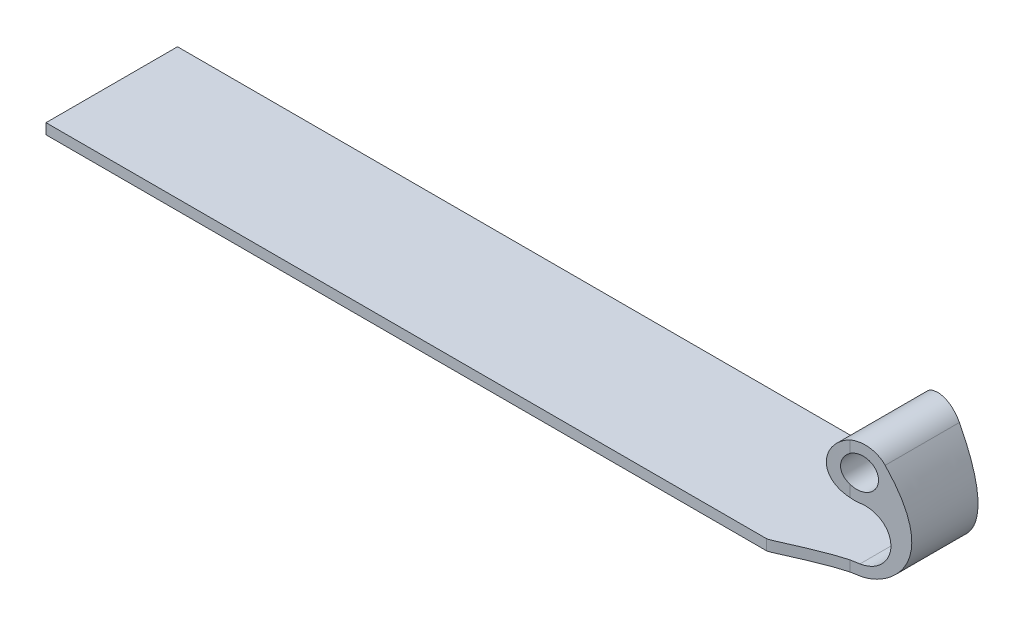
ISO-10303-21;
HEADER;
FILE_DESCRIPTION(('STEP AP214'),'2;1');
FILE_NAME('part.step','',(''),(''),'','','');
FILE_SCHEMA(('AUTOMOTIVE_DESIGN { 1 0 10303 214 1 1 1 1 }'));
ENDSEC;
DATA;
#1=APPLICATION_CONTEXT('core data for automotive mechanical design processes');
#2=APPLICATION_PROTOCOL_DEFINITION('international standard','automotive_design',2000,#1);
#3=PRODUCT_CONTEXT('',#1,'mechanical');
#4=PRODUCT('Part','Part','',(#3));
#5=PRODUCT_RELATED_PRODUCT_CATEGORY('part','',(#4));
#6=PRODUCT_DEFINITION_FORMATION('','',#4);
#7=PRODUCT_DEFINITION_CONTEXT('part definition',#1,'design');
#8=PRODUCT_DEFINITION('design','',#6,#7);
#9=PRODUCT_DEFINITION_SHAPE('','',#8);
#10=(LENGTH_UNIT() NAMED_UNIT(*) SI_UNIT(.MILLI.,.METRE.));
#11=(NAMED_UNIT(*) PLANE_ANGLE_UNIT() SI_UNIT($,.RADIAN.));
#12=(NAMED_UNIT(*) SI_UNIT($,.STERADIAN.) SOLID_ANGLE_UNIT());
#13=UNCERTAINTY_MEASURE_WITH_UNIT(LENGTH_MEASURE(1.E-05),#10,'distance_accuracy_value','');
#14=(GEOMETRIC_REPRESENTATION_CONTEXT(3) GLOBAL_UNCERTAINTY_ASSIGNED_CONTEXT((#13)) GLOBAL_UNIT_ASSIGNED_CONTEXT((#10,
#11,#12)) REPRESENTATION_CONTEXT('',''));
#15=CARTESIAN_POINT('',(0.,0.,0.));
#16=DIRECTION('',(0.,0.,1.));
#17=DIRECTION('',(1.,0.,0.));
#18=AXIS2_PLACEMENT_3D('',#15,#16,#17);
#19=CARTESIAN_POINT('',(-38.1,1.016,-6.35));
#20=DIRECTION('',(0.,0.,1.));
#21=DIRECTION('',(1.,0.,0.));
#22=AXIS2_PLACEMENT_3D('',#19,#20,#21);
#23=PLANE('',#22);
#24=DIRECTION('',(0.,1.,0.));
#25=VECTOR('',#24,1.);
#26=CARTESIAN_POINT('',(31.4618728230442,-8.984,-6.35));
#27=LINE('',#26,#25);
#28=CARTESIAN_POINT('',(31.4618728230442,0.,-6.35));
#29=VERTEX_POINT('',#28);
#30=CARTESIAN_POINT('',(31.4618728230442,1.016,-6.35));
#31=VERTEX_POINT('',#30);
#32=EDGE_CURVE('E257',#29,#31,#27,.T.);
#33=ORIENTED_EDGE('',*,*,#32,.F.);
#34=DIRECTION('',(-1.,0.,0.));
#35=VECTOR('',#34,1.);
#36=CARTESIAN_POINT('',(-38.1,0.,-6.35));
#37=LINE('',#36,#35);
#38=CARTESIAN_POINT('',(-38.1,0.,-6.35));
#39=VERTEX_POINT('',#38);
#40=EDGE_CURVE('E277',#29,#39,#37,.T.);
#41=ORIENTED_EDGE('',*,*,#40,.T.);
#42=DIRECTION('',(0.,-1.,0.));
#43=VECTOR('',#42,1.);
#44=CARTESIAN_POINT('',(-38.1,1.016,-6.35));
#45=LINE('',#44,#43);
#46=CARTESIAN_POINT('',(-38.1,1.016,-6.35));
#47=VERTEX_POINT('',#46);
#48=EDGE_CURVE('E311',#47,#39,#45,.T.);
#49=ORIENTED_EDGE('',*,*,#48,.F.);
#50=DIRECTION('',(-1.,0.,0.));
#51=VECTOR('',#50,1.);
#52=CARTESIAN_POINT('',(-38.1,1.016,-6.35));
#53=LINE('',#52,#51);
#54=EDGE_CURVE('E292',#31,#47,#53,.T.);
#55=ORIENTED_EDGE('',*,*,#54,.F.);
#56=EDGE_LOOP('',(#33,#41,#49,#55));
#57=FACE_BOUND('',#56,.T.);
#58=ADVANCED_FACE('F37',(#57),#23,.F.);
#59=CARTESIAN_POINT('',(0.,1.016,0.));
#60=DIRECTION('',(0.,-1.,0.));
#61=DIRECTION('',(0.,0.,-1.));
#62=AXIS2_PLACEMENT_3D('',#59,#60,#61);
#63=PLANE('',#62);
#64=CARTESIAN_POINT('',(39.2056630331056,1.016,-3.75211753897652));
#65=CARTESIAN_POINT('',(36.3576672367003,1.016,-3.87614198539521));
#66=CARTESIAN_POINT('',(31.9938209662141,1.016,-6.35));
#67=CARTESIAN_POINT('',(31.4618728230442,1.016,-6.35));
#68=B_SPLINE_CURVE_WITH_KNOTS('',3,(#64,#65,#66,#67),.UNSPECIFIED.,.F.,.F.,(4,4),(0.,1.),.UNSPECIFIED.);
#69=CARTESIAN_POINT('',(37.2738999237345,1.016,-4.09273949549593));
#70=VERTEX_POINT('',#69);
#71=EDGE_CURVE('E281',#31,#70,#68,.F.);
#72=ORIENTED_EDGE('',*,*,#71,.F.);
#73=ORIENTED_EDGE('',*,*,#54,.T.);
#74=DIRECTION('',(0.,0.,1.));
#75=VECTOR('',#74,1.);
#76=CARTESIAN_POINT('',(-38.1,1.016,6.35));
#77=LINE('',#76,#75);
#78=CARTESIAN_POINT('',(-38.1,1.016,6.35));
#79=VERTEX_POINT('',#78);
#80=EDGE_CURVE('E296',#47,#79,#77,.T.);
#81=ORIENTED_EDGE('',*,*,#80,.T.);
#82=DIRECTION('',(1.,0.,0.));
#83=VECTOR('',#82,1.);
#84=CARTESIAN_POINT('',(-38.1,1.016,6.35));
#85=LINE('',#84,#83);
#86=CARTESIAN_POINT('',(31.4618728230442,1.016,6.35));
#87=VERTEX_POINT('',#86);
#88=EDGE_CURVE('E298',#79,#87,#85,.T.);
#89=ORIENTED_EDGE('',*,*,#88,.T.);
#90=CARTESIAN_POINT('',(39.2056630331056,1.016,3.75211753897652));
#91=CARTESIAN_POINT('',(36.3576672367003,1.016,3.87614198539521));
#92=CARTESIAN_POINT('',(31.9938209662141,1.016,6.35));
#93=CARTESIAN_POINT('',(31.4618728230442,1.016,6.35));
#94=B_SPLINE_CURVE_WITH_KNOTS('',3,(#90,#91,#92,#93),.UNSPECIFIED.,.F.,.F.,(4,4),(0.,1.),.UNSPECIFIED.);
#95=CARTESIAN_POINT('',(37.2738999237345,1.016,4.09273949549593));
#96=VERTEX_POINT('',#95);
#97=EDGE_CURVE('E180',#87,#96,#94,.F.);
#98=ORIENTED_EDGE('',*,*,#97,.T.);
#99=DIRECTION('',(-0.984807753012208,0.,0.173648177666931));
#100=VECTOR('',#99,1.);
#101=CARTESIAN_POINT('',(1.82384528316646,1.016,10.3435405962174));
#102=LINE('',#101,#100);
#103=CARTESIAN_POINT('',(38.1,1.016,3.94707576328499));
#104=VERTEX_POINT('',#103);
#105=EDGE_CURVE('E187',#104,#96,#102,.T.);
#106=ORIENTED_EDGE('',*,*,#105,.F.);
#107=DIRECTION('',(0.,0.,-1.));
#108=VECTOR('',#107,1.);
#109=CARTESIAN_POINT('',(38.1,1.016,6.35));
#110=LINE('',#109,#108);
#111=CARTESIAN_POINT('',(38.1,1.016,-3.94707576328499));
#112=VERTEX_POINT('',#111);
#113=EDGE_CURVE('E289',#104,#112,#110,.T.);
#114=ORIENTED_EDGE('',*,*,#113,.T.);
#115=DIRECTION('',(-0.984807753012208,0.,-0.173648177666931));
#116=VECTOR('',#115,1.);
#117=CARTESIAN_POINT('',(1.82384528316646,1.016,-10.3435405962174));
#118=LINE('',#117,#116);
#119=EDGE_CURVE('E342',#112,#70,#118,.T.);
#120=ORIENTED_EDGE('',*,*,#119,.T.);
#121=EDGE_LOOP('',(#72,#73,#81,#89,#98,#106,#114,#120));
#122=FACE_BOUND('',#121,.T.);
#123=ADVANCED_FACE('F353',(#122),#63,.F.);
#124=CARTESIAN_POINT('',(0.,0.,0.));
#125=DIRECTION('',(0.,-1.,0.));
#126=DIRECTION('',(0.,0.,-1.));
#127=AXIS2_PLACEMENT_3D('',#124,#125,#126);
#128=PLANE('',#127);
#129=ORIENTED_EDGE('',*,*,#40,.F.);
#130=CARTESIAN_POINT('',(39.2056630331056,0.,-3.75211753897652));
#131=CARTESIAN_POINT('',(36.3576672367003,0.,-3.87614198539521));
#132=CARTESIAN_POINT('',(31.9938209662141,0.,-6.35));
#133=CARTESIAN_POINT('',(31.4618728230442,0.,-6.35));
#134=B_SPLINE_CURVE_WITH_KNOTS('',3,(#130,#131,#132,#133),.UNSPECIFIED.,.F.,.F.,(4,4),(0.,1.),.UNSPECIFIED.);
#135=CARTESIAN_POINT('',(37.2738999237345,0.,-4.09273949549593));
#136=VERTEX_POINT('',#135);
#137=EDGE_CURVE('E369',#29,#136,#134,.F.);
#138=ORIENTED_EDGE('',*,*,#137,.T.);
#139=DIRECTION('',(-0.984807753012208,0.,-0.173648177666931));
#140=VECTOR('',#139,1.);
#141=CARTESIAN_POINT('',(1.82384528316646,0.,-10.3435405962174));
#142=LINE('',#141,#140);
#143=CARTESIAN_POINT('',(38.1,0.,-3.94707576328499));
#144=VERTEX_POINT('',#143);
#145=EDGE_CURVE('E340',#144,#136,#142,.T.);
#146=ORIENTED_EDGE('',*,*,#145,.F.);
#147=DIRECTION('',(0.,0.,-1.));
#148=VECTOR('',#147,1.);
#149=CARTESIAN_POINT('',(38.1,0.,6.35));
#150=LINE('',#149,#148);
#151=CARTESIAN_POINT('',(38.1,0.,3.94707576328499));
#152=VERTEX_POINT('',#151);
#153=EDGE_CURVE('E196',#152,#144,#150,.T.);
#154=ORIENTED_EDGE('',*,*,#153,.F.);
#155=DIRECTION('',(-0.984807753012208,0.,0.173648177666931));
#156=VECTOR('',#155,1.);
#157=CARTESIAN_POINT('',(1.82384528316646,0.,10.3435405962174));
#158=LINE('',#157,#156);
#159=CARTESIAN_POINT('',(37.2738999237345,0.,4.09273949549593));
#160=VERTEX_POINT('',#159);
#161=EDGE_CURVE('E184',#152,#160,#158,.T.);
#162=ORIENTED_EDGE('',*,*,#161,.T.);
#163=CARTESIAN_POINT('',(39.2056630331056,0.,3.75211753897652));
#164=CARTESIAN_POINT('',(36.3576672367003,0.,3.87614198539521));
#165=CARTESIAN_POINT('',(31.9938209662141,0.,6.35));
#166=CARTESIAN_POINT('',(31.4618728230442,0.,6.35));
#167=B_SPLINE_CURVE_WITH_KNOTS('',3,(#163,#164,#165,#166),.UNSPECIFIED.,.F.,.F.,(4,4),(0.,1.),.UNSPECIFIED.);
#168=CARTESIAN_POINT('',(31.4618728230442,0.,6.35));
#169=VERTEX_POINT('',#168);
#170=EDGE_CURVE('E168',#169,#160,#167,.F.);
#171=ORIENTED_EDGE('',*,*,#170,.F.);
#172=DIRECTION('',(1.,0.,0.));
#173=VECTOR('',#172,1.);
#174=CARTESIAN_POINT('',(-38.1,0.,6.35));
#175=LINE('',#174,#173);
#176=CARTESIAN_POINT('',(-38.1,0.,6.35));
#177=VERTEX_POINT('',#176);
#178=EDGE_CURVE('E293',#177,#169,#175,.T.);
#179=ORIENTED_EDGE('',*,*,#178,.F.);
#180=DIRECTION('',(0.,0.,1.));
#181=VECTOR('',#180,1.);
#182=CARTESIAN_POINT('',(-38.1,0.,6.35));
#183=LINE('',#182,#181);
#184=EDGE_CURVE('E305',#39,#177,#183,.T.);
#185=ORIENTED_EDGE('',*,*,#184,.F.);
#186=EDGE_LOOP('',(#129,#138,#146,#154,#162,#171,#179,#185));
#187=FACE_BOUND('',#186,.T.);
#188=ADVANCED_FACE('F193',(#187),#128,.T.);
#189=CARTESIAN_POINT('',(38.1,3.556,6.35));
#190=DIRECTION('',(0.,0.,-1.));
#191=DIRECTION('',(-1.,0.,0.));
#192=AXIS2_PLACEMENT_3D('',#189,#190,#191);
#193=CYLINDRICAL_SURFACE('',#192,2.54);
#194=CARTESIAN_POINT('',(38.1,3.556,-3.94707576328499));
#195=DIRECTION('',(-0.173648177666931,0.,0.984807753012208));
#196=DIRECTION('',(-0.984807753012208,0.,-0.173648177666931));
#197=AXIS2_PLACEMENT_3D('',#194,#195,#196);
#198=ELLIPSE('',#197,2.57918359418979,2.54);
#199=CARTESIAN_POINT('',(38.1,6.096,-3.94707576328499));
#200=VERTEX_POINT('',#199);
#201=EDGE_CURVE('E72',#112,#200,#198,.T.);
#202=ORIENTED_EDGE('',*,*,#201,.F.);
#203=ORIENTED_EDGE('',*,*,#113,.F.);
#204=CARTESIAN_POINT('',(38.1,3.556,3.94707576328499));
#205=DIRECTION('',(0.173648177666931,0.,0.984807753012208));
#206=DIRECTION('',(0.984807753012208,0.,-0.173648177666931));
#207=AXIS2_PLACEMENT_3D('',#204,#205,#206);
#208=ELLIPSE('',#207,2.57918359418979,2.54);
#209=CARTESIAN_POINT('',(38.1,6.096,3.94707576328499));
#210=VERTEX_POINT('',#209);
#211=EDGE_CURVE('E256',#104,#210,#208,.T.);
#212=ORIENTED_EDGE('',*,*,#211,.T.);
#213=DIRECTION('',(0.,0.,-1.));
#214=VECTOR('',#213,1.);
#215=CARTESIAN_POINT('',(38.1,6.096,6.35));
#216=LINE('',#215,#214);
#217=EDGE_CURVE('E274',#210,#200,#216,.T.);
#218=ORIENTED_EDGE('',*,*,#217,.T.);
#219=EDGE_LOOP('',(#202,#203,#212,#218));
#220=FACE_BOUND('',#219,.T.);
#221=ADVANCED_FACE('F331',(#220),#193,.F.);
#222=CARTESIAN_POINT('',(40.16864649384,10.1098730215061,6.35));
#223=CARTESIAN_POINT('',(43.8111052533142,4.99751976461316,6.35));
#224=CARTESIAN_POINT('',(42.8225920973942,1.81527670168074,6.35));
#225=CARTESIAN_POINT('',(40.0156055783276,0.,6.35));
#226=CARTESIAN_POINT('',(38.1,0.,6.35));
#227=B_SPLINE_CURVE_WITH_KNOTS('',4,(#222,#223,#224,#225,#226),.UNSPECIFIED.,.F.,.F.,(5,5),(0.,
1.),.UNSPECIFIED.);
#228=DIRECTION('',(0.,0.,-1.));
#229=VECTOR('',#228,1.);
#230=SURFACE_OF_LINEAR_EXTRUSION('',#227,#229);
#231=CARTESIAN_POINT('',(40.16864649384,10.1098730215061,-3.58231757287303));
#232=CARTESIAN_POINT('',(40.2386971006965,10.0115503921679,-3.56996576086924));
#233=CARTESIAN_POINT('',(40.3078609482853,9.91257827008157,-3.55777030844972));
#234=CARTESIAN_POINT('',(40.4442630934014,9.71326212595249,-3.53371893003924));
#235=CARTESIAN_POINT('',(40.5115012098462,9.61291797619587,-3.52186303597801));
#236=CARTESIAN_POINT('',(40.7111666601818,9.30808598208403,-3.48665662996853));
#237=CARTESIAN_POINT('',(40.8403888691159,9.10141147482652,-3.46387126802671));
#238=CARTESIAN_POINT('',(41.0890503345616,8.68117261554222,-3.42002554260613));
#239=CARTESIAN_POINT('',(41.208457601893,8.46758866890948,-3.39897081968292));
#240=CARTESIAN_POINT('',(41.4380547901414,8.02771259792472,-3.35848664069993));
#241=CARTESIAN_POINT('',(41.5478984433418,7.80123237548273,-3.33911824098112));
#242=CARTESIAN_POINT('',(41.7513317726157,7.34151988880115,-3.30324745625479));
#243=CARTESIAN_POINT('',(41.8449634162293,7.10830693851338,-3.28673767123763));
#244=CARTESIAN_POINT('',(42.0124615263438,6.63506163253428,-3.25720323520675));
#245=CARTESIAN_POINT('',(42.0863692722308,6.39504470073996,-3.24417130552353));
#246=CARTESIAN_POINT('',(42.1834881559347,6.01322148353508,-3.22704662599025));
#247=CARTESIAN_POINT('',(42.214837002818,5.87353251454589,-3.22151897847063));
#248=CARTESIAN_POINT('',(42.268744804046,5.59236639544677,-3.21201357864346));
#249=CARTESIAN_POINT('',(42.2913024294141,5.45088897831049,-3.20803606067036));
#250=CARTESIAN_POINT('',(42.3265239314003,5.16737668776498,-3.2018255595691));
#251=CARTESIAN_POINT('',(42.3392372188921,5.02534824220722,-3.1995838639708));
#252=CARTESIAN_POINT('',(42.3539660243098,4.74070139310319,-3.19698677818204));
#253=CARTESIAN_POINT('',(42.3559819118455,4.59808301011045,-3.19663132281944));
#254=CARTESIAN_POINT('',(42.3483476308648,4.31128963571942,-3.19797745253463));
#255=CARTESIAN_POINT('',(42.3385457206322,4.16711846367507,-3.19970579377113));
#256=CARTESIAN_POINT('',(42.3062410942784,3.8802275806142,-3.20540197099901));
#257=CARTESIAN_POINT('',(42.2837384622386,3.73750785999512,-3.20936979216457));
#258=CARTESIAN_POINT('',(42.225531581333,3.45482101833737,-3.21963323573112));
#259=CARTESIAN_POINT('',(42.1898244755356,3.31485449989116,-3.22592936188622));
#260=CARTESIAN_POINT('',(42.1050855085221,3.03914255532555,-3.24087112808807));
#261=CARTESIAN_POINT('',(42.0560550300351,2.90339669280546,-3.24951652432237));
#262=CARTESIAN_POINT('',(41.9502786701516,2.65026019481218,-3.26816775049095));
#263=CARTESIAN_POINT('',(41.8947203608108,2.53235626387664,-3.27796417943029));
#264=CARTESIAN_POINT('',(41.7734191712382,2.30208880756606,-3.29935285194397));
#265=CARTESIAN_POINT('',(41.707676828551,2.18972499017927,-3.31094500073471));
#266=CARTESIAN_POINT('',(41.566685084056,1.97137411142382,-3.33580564934632));
#267=CARTESIAN_POINT('',(41.4914384791459,1.86538518755328,-3.34907365599869));
#268=CARTESIAN_POINT('',(41.3322338568475,1.66042604215021,-3.3771457263634));
#269=CARTESIAN_POINT('',(41.2482757826258,1.56145586641487,-3.391949800097));
#270=CARTESIAN_POINT('',(40.9925669877352,1.28452862680677,-3.43703815984066));
#271=CARTESIAN_POINT('',(40.8103039867785,1.11642238418552,-3.46917604449422));
#272=CARTESIAN_POINT('',(40.4221689147632,0.810059085235462,-3.53761472984975));
#273=CARTESIAN_POINT('',(40.2162333871074,0.671885262989268,-3.57392671966189));
#274=CARTESIAN_POINT('',(39.8837728112507,0.484105947700569,-3.63254848920731));
#275=CARTESIAN_POINT('',(39.7635600730315,0.42274220741561,-3.6537452383802));
#276=CARTESIAN_POINT('',(39.5182703423196,0.310716955437027,-3.69699643599541));
#277=CARTESIAN_POINT('',(39.3931909409632,0.260060825604466,-3.71905130918541));
#278=CARTESIAN_POINT('',(39.1396623463231,0.170855435873748,-3.76375524080156));
#279=CARTESIAN_POINT('',(39.0112351362557,0.132241935880676,-3.78640042299356));
#280=CARTESIAN_POINT('',(38.751268374278,0.0684318092392878,-3.83223957721764));
#281=CARTESIAN_POINT('',(38.6197333219364,0.0432168946400924,-3.85543275585438));
#282=CARTESIAN_POINT('',(38.4230399510609,0.0176186520217874,-3.89011510406622));
#283=CARTESIAN_POINT('',(38.3586323474542,0.0111354913284841,-3.90147190234486));
#284=CARTESIAN_POINT('',(38.2294969968974,0.00233240004275009,-3.92424194881126));
#285=CARTESIAN_POINT('',(38.1647690439846,1.56345411210961E-05,-3.93565523331582));
#286=CARTESIAN_POINT('',(38.1,0.,-3.947075763285));
#287=B_SPLINE_CURVE_WITH_KNOTS('',3,(#231,#232,#233,#234,#235,#236,#237,#238,#239,#240,#241,
#242,#243,#244,#245,#246,#247,#248,#249,#250,#251,#252,#253,#254,#255,#256,#257,#258,#259,#260,
#261,#262,#263,#264,#265,#266,#267,#268,#269,#270,#271,#272,#273,#274,#275,#276,#277,#278,#279,
#280,#281,#282,#283,#284,#285,#286),.UNSPECIFIED.,.F.,.F.,(4,2,2,2,2,2,2,2,2,2,2,2,2,2,2,2,2,2,
2,2,2,2,2,2,2,2,2,4),(0.,0.364054419826309,0.728142961171223,1.46230043845645,2.19876293670766,
2.95559414113654,3.71043587607158,4.46368521761982,4.89325492985614,5.32288955535543,
5.7503535162043,6.17780270749931,6.61079933833974,7.04379310268497,7.4768806048057,
7.90992317730252,8.30151945164267,8.69309506336898,9.08455571022149,9.47601891111124,
10.2228279662134,10.9716877737666,11.381136446,11.790790428605,12.1982202246698,
12.6050924752566,12.8021412284295,12.9993396107504),.UNSPECIFIED.);
#288=CARTESIAN_POINT('',(40.16864649384,10.1098730215061,-3.58231757287303));
#289=VERTEX_POINT('',#288);
#290=EDGE_CURVE('E272',#289,#144,#287,.T.);
#291=ORIENTED_EDGE('',*,*,#290,.F.);
#292=DIRECTION('',(0.,0.,-1.));
#293=VECTOR('',#292,1.);
#294=CARTESIAN_POINT('',(40.16864649384,10.1098730215061,6.35));
#295=LINE('',#294,#293);
#296=CARTESIAN_POINT('',(40.16864649384,10.1098730215061,3.58231757287303));
#297=VERTEX_POINT('',#296);
#298=EDGE_CURVE('E269',#297,#289,#295,.T.);
#299=ORIENTED_EDGE('',*,*,#298,.F.);
#300=CARTESIAN_POINT('',(40.16864649384,10.1098730215061,3.58231757287303));
#301=CARTESIAN_POINT('',(40.2386971006964,10.0115503921679,3.56996576086924));
#302=CARTESIAN_POINT('',(40.3078609482853,9.91257827008156,3.55777030844972));
#303=CARTESIAN_POINT('',(40.4442630934014,9.71326212595249,3.53371893003924));
#304=CARTESIAN_POINT('',(40.5115012098462,9.61291797619587,3.521863035978));
#305=CARTESIAN_POINT('',(40.7111666601818,9.30808598208404,3.48665662996853));
#306=CARTESIAN_POINT('',(40.8403888691159,9.10141147482651,3.46387126802671));
#307=CARTESIAN_POINT('',(41.0890503345615,8.68117261554222,3.42002554260613));
#308=CARTESIAN_POINT('',(41.208457601893,8.46758866890949,3.39897081968292));
#309=CARTESIAN_POINT('',(41.4380547901414,8.02771259792473,3.35848664069993));
#310=CARTESIAN_POINT('',(41.5478984433418,7.80123237548274,3.33911824098112));
#311=CARTESIAN_POINT('',(41.7513317726156,7.34151988880116,3.30324745625479));
#312=CARTESIAN_POINT('',(41.8449634162293,7.10830693851339,3.28673767123762));
#313=CARTESIAN_POINT('',(42.0124615263438,6.63506163253429,3.25720323520675));
#314=CARTESIAN_POINT('',(42.0863692722308,6.39504470073996,3.24417130552353));
#315=CARTESIAN_POINT('',(42.1834881559347,6.01322148353508,3.22704662599025));
#316=CARTESIAN_POINT('',(42.214837002818,5.87353251454589,3.22151897847062));
#317=CARTESIAN_POINT('',(42.268744804046,5.59236639544677,3.21201357864346));
#318=CARTESIAN_POINT('',(42.2913024294141,5.45088897831049,3.20803606067036));
#319=CARTESIAN_POINT('',(42.3265239314003,5.16737668776498,3.2018255595691));
#320=CARTESIAN_POINT('',(42.3392372188921,5.02534824220722,3.1995838639708));
#321=CARTESIAN_POINT('',(42.3539660243098,4.74070139310319,3.19698677818204));
#322=CARTESIAN_POINT('',(42.3559819118455,4.59808301011044,3.19663132281943));
#323=CARTESIAN_POINT('',(42.3483476308648,4.31128963571942,3.19797745253463));
#324=CARTESIAN_POINT('',(42.3385457206322,4.16711846367507,3.19970579377113));
#325=CARTESIAN_POINT('',(42.3062410942784,3.88022758061419,3.20540197099902));
#326=CARTESIAN_POINT('',(42.2837384622386,3.73750785999512,3.20936979216458));
#327=CARTESIAN_POINT('',(42.225531581333,3.45482101833736,3.21963323573112));
#328=CARTESIAN_POINT('',(42.1898244755356,3.31485449989114,3.22592936188622));
#329=CARTESIAN_POINT('',(42.1050855085221,3.03914255532555,3.24087112808806));
#330=CARTESIAN_POINT('',(42.0560550300351,2.90339669280546,3.24951652432237));
#331=CARTESIAN_POINT('',(41.9502786701516,2.65026019481218,3.26816775049096));
#332=CARTESIAN_POINT('',(41.8947203608108,2.53235626387663,3.27796417943029));
#333=CARTESIAN_POINT('',(41.7734191712382,2.30208880756605,3.29935285194397));
#334=CARTESIAN_POINT('',(41.707676828551,2.18972499017926,3.31094500073471));
#335=CARTESIAN_POINT('',(41.566685084056,1.97137411142381,3.33580564934632));
#336=CARTESIAN_POINT('',(41.4914384791459,1.86538518755327,3.34907365599869));
#337=CARTESIAN_POINT('',(41.3322338568474,1.6604260421502,3.37714572636341));
#338=CARTESIAN_POINT('',(41.2482757826258,1.56145586641486,3.39194980009701));
#339=CARTESIAN_POINT('',(40.9925669877352,1.28452862680677,3.43703815984066));
#340=CARTESIAN_POINT('',(40.8103039867785,1.11642238418552,3.46917604449422));
#341=CARTESIAN_POINT('',(40.4221689147632,0.810059085235468,3.53761472984975));
#342=CARTESIAN_POINT('',(40.2162333871074,0.671885262989276,3.57392671966189));
#343=CARTESIAN_POINT('',(39.8837728112507,0.484105947700578,3.6325484892073));
#344=CARTESIAN_POINT('',(39.7635600730315,0.422742207415618,3.6537452383802));
#345=CARTESIAN_POINT('',(39.5182703423196,0.310716955437034,3.69699643599541));
#346=CARTESIAN_POINT('',(39.3931909409632,0.260060825604473,3.71905130918541));
#347=CARTESIAN_POINT('',(39.1396623463231,0.170855435873755,3.76375524080155));
#348=CARTESIAN_POINT('',(39.0112351362557,0.13224193588068,3.78640042299355));
#349=CARTESIAN_POINT('',(38.7512683742781,0.0684318092392889,3.83223957721763));
#350=CARTESIAN_POINT('',(38.6197333219364,0.043216894640093,3.85543275585438));
#351=CARTESIAN_POINT('',(38.4230399510609,0.0176186520217876,3.89011510406622));
#352=CARTESIAN_POINT('',(38.3586323474542,0.0111354913284841,3.90147190234486));
#353=CARTESIAN_POINT('',(38.2294969968974,0.0023324000427504,3.92424194881125));
#354=CARTESIAN_POINT('',(38.1647690439846,1.56345411215077E-05,3.93565523331582));
#355=CARTESIAN_POINT('',(38.1,0.,3.94707576328499));
#356=B_SPLINE_CURVE_WITH_KNOTS('',3,(#300,#301,#302,#303,#304,#305,#306,#307,#308,#309,#310,
#311,#312,#313,#314,#315,#316,#317,#318,#319,#320,#321,#322,#323,#324,#325,#326,#327,#328,#329,
#330,#331,#332,#333,#334,#335,#336,#337,#338,#339,#340,#341,#342,#343,#344,#345,#346,#347,#348,
#349,#350,#351,#352,#353,#354,#355),.UNSPECIFIED.,.F.,.F.,(4,2,2,2,2,2,2,2,2,2,2,2,2,2,2,2,2,2,
2,2,2,2,2,2,2,2,2,4),(0.,0.364054419826313,0.728142961171225,1.46230043845645,2.19876293670765,
2.95559414113653,3.71043587607157,4.46368521761982,4.89325492985614,5.32288955535543,
5.7503535162043,6.17780270749931,6.61079933833975,7.04379310268498,7.47688060480571,
7.90992317730253,8.30151945164268,8.69309506336899,9.08455571022151,9.47601891111125,
10.2228279662134,10.9716877737666,11.381136446,11.790790428605,12.1982202246698,
12.6050924752566,12.8021412284295,12.9993396107504),.UNSPECIFIED.);
#357=EDGE_CURVE('E198',#297,#152,#356,.T.);
#358=ORIENTED_EDGE('',*,*,#357,.T.);
#359=ORIENTED_EDGE('',*,*,#153,.T.);
#360=EDGE_LOOP('',(#291,#299,#358,#359));
#361=FACE_BOUND('',#360,.T.);
#362=ADVANCED_FACE('F271',(#361),#230,.T.);
#363=CARTESIAN_POINT('',(38.1,8.636,6.35));
#364=DIRECTION('',(0.,0.,-1.));
#365=DIRECTION('',(-1.,0.,0.));
#366=AXIS2_PLACEMENT_3D('',#363,#364,#365);
#367=CYLINDRICAL_SURFACE('',#366,2.54);
#368=CARTESIAN_POINT('',(38.1,8.636,-3.94707576328499));
#369=DIRECTION('',(-0.173648177666931,0.,0.984807753012208));
#370=DIRECTION('',(-0.984807753012208,0.,-0.173648177666931));
#371=AXIS2_PLACEMENT_3D('',#368,#369,#370);
#372=ELLIPSE('',#371,2.57918359418979,2.54);
#373=CARTESIAN_POINT('',(37.2738999237345,11.0379072971274,-4.09273949549593));
#374=VERTEX_POINT('',#373);
#375=EDGE_CURVE('E341',#374,#289,#372,.F.);
#376=ORIENTED_EDGE('',*,*,#375,.F.);
#377=CARTESIAN_POINT('',(37.2738999403494,11.0379073028419,-4.09273949091969));
#378=CARTESIAN_POINT('',(37.2045037892503,11.0140353486144,-4.11185431943039));
#379=CARTESIAN_POINT('',(37.1362390354365,10.9871958840568,-4.13121851050796));
#380=CARTESIAN_POINT('',(37.0023326205583,10.9277464139611,-4.17016070501194));
#381=CARTESIAN_POINT('',(36.9366909849326,10.8951363524768,-4.18973871050955));
#382=CARTESIAN_POINT('',(36.7441998517194,10.7888738479148,-4.24837871048672));
#383=CARTESIAN_POINT('',(36.6218315149095,10.7068054389988,-4.28733338510817));
#384=CARTESIAN_POINT('',(36.3925505212813,10.5222437445872,-4.36254198524669));
#385=CARTESIAN_POINT('',(36.2856506347464,10.4197337472847,-4.39879366742324));
#386=CARTESIAN_POINT('',(36.0906717447484,10.196797535508,-4.46632338227667));
#387=CARTESIAN_POINT('',(36.0025791043773,10.0763844105873,-4.49760501443804));
#388=CARTESIAN_POINT('',(35.8504137181982,9.82429306776502,-4.55240211630605));
#389=CARTESIAN_POINT('',(35.7857476396444,9.6930151481335,-4.57610731136554));
#390=CARTESIAN_POINT('',(35.6796662921259,9.42020585252147,-4.61530793316967));
#391=CARTESIAN_POINT('',(35.6382455967444,9.27867687827078,-4.63080527591289));
#392=CARTESIAN_POINT('',(35.5822272585922,8.99870278289426,-4.65182838564265));
#393=CARTESIAN_POINT('',(35.5661515368078,8.86059357526938,-4.65790326804556));
#394=CARTESIAN_POINT('',(35.5567647892007,8.58351503700823,-4.66144606444535));
#395=CARTESIAN_POINT('',(35.5634472115514,8.44454596541583,-4.65891645558359));
#396=CARTESIAN_POINT('',(35.5986704959378,8.1746422397811,-4.64565341053266));
#397=CARTESIAN_POINT('',(35.6264632702475,8.04359488685331,-4.6352007685831));
#398=CARTESIAN_POINT('',(35.7019632017812,7.78820673732337,-4.60705791941003));
#399=CARTESIAN_POINT('',(35.7496709072729,7.6638661254675,-4.58936751292762));
#400=CARTESIAN_POINT('',(35.8644096102553,7.42278523607515,-4.54737363223449));
#401=CARTESIAN_POINT('',(35.9317818239571,7.30622816426661,-4.52295384934066));
#402=CARTESIAN_POINT('',(36.0833751814713,7.08592997881478,-4.46899751238524));
#403=CARTESIAN_POINT('',(36.1676044223746,6.98219506304033,-4.43945850027479));
#404=CARTESIAN_POINT('',(36.3556839412402,6.7843452808789,-4.37505473041564));
#405=CARTESIAN_POINT('',(36.4603669051504,6.69109039644563,-4.3399847517229));
#406=CARTESIAN_POINT('',(36.6830952149677,6.5233270439492,-4.26780169032599));
#407=CARTESIAN_POINT('',(36.8011295936715,6.44880334942886,-4.23069029718338));
#408=CARTESIAN_POINT('',(36.9806433655096,6.35505991758673,-4.17664066839133));
#409=CARTESIAN_POINT('',(37.0380352863863,6.327781404543,-4.15968912283526));
#410=CARTESIAN_POINT('',(37.1546380924911,6.27763099036508,-4.12600946208422));
#411=CARTESIAN_POINT('',(37.2138453127007,6.25475081133886,-4.10928098342607));
#412=CARTESIAN_POINT('',(37.2738999403494,6.23409269715811,-4.09273949091969));
#413=B_SPLINE_CURVE_WITH_KNOTS('',3,(#377,#378,#379,#380,#381,#382,#383,#384,#385,#386,#387,
#388,#389,#390,#391,#392,#393,#394,#395,#396,#397,#398,#399,#400,#401,#402,#403,#404,#405,#406,
#407,#408,#409,#410,#411,#412),.UNSPECIFIED.,.F.,.F.,(4,2,2,2,2,2,2,2,2,2,2,2,2,2,2,2,2,4),(0.,
0.227365254410789,0.454732713253839,0.909621286429405,1.36488328502632,1.81981404898019,
2.26224831484584,2.70457925557381,3.12000927102645,3.53531969872645,3.9365621391007,
4.33781562660353,4.74649374957276,5.15536864986083,5.58706243469513,6.01840415530432,
6.21556037994106,6.41234183341763),.UNSPECIFIED.);
#414=CARTESIAN_POINT('',(37.2738999237345,6.23409270287255,-4.09273949549593));
#415=VERTEX_POINT('',#414);
#416=EDGE_CURVE('E381',#374,#415,#413,.T.);
#417=ORIENTED_EDGE('',*,*,#416,.T.);
#418=EDGE_CURVE('E415',#200,#415,#372,.F.);
#419=ORIENTED_EDGE('',*,*,#418,.F.);
#420=ORIENTED_EDGE('',*,*,#217,.F.);
#421=CARTESIAN_POINT('',(38.1,8.636,3.94707576328499));
#422=DIRECTION('',(0.173648177666931,0.,0.984807753012208));
#423=DIRECTION('',(0.984807753012208,0.,-0.173648177666931));
#424=AXIS2_PLACEMENT_3D('',#421,#422,#423);
#425=ELLIPSE('',#424,2.57918359418979,2.54);
#426=CARTESIAN_POINT('',(37.2738999237345,6.23409270287256,4.09273949549593));
#427=VERTEX_POINT('',#426);
#428=EDGE_CURVE('E252',#210,#427,#425,.F.);
#429=ORIENTED_EDGE('',*,*,#428,.T.);
#430=CARTESIAN_POINT('',(37.2738999403494,11.0379073028419,4.09273949091969));
#431=CARTESIAN_POINT('',(37.2045037892503,11.0140353486144,4.11185431943039));
#432=CARTESIAN_POINT('',(37.1362390354365,10.9871958840568,4.13121851050797));
#433=CARTESIAN_POINT('',(37.0023326205583,10.9277464139611,4.17016070501194));
#434=CARTESIAN_POINT('',(36.9366909849326,10.8951363524767,4.18973871050955));
#435=CARTESIAN_POINT('',(36.7441998517194,10.7888738479148,4.24837871048672));
#436=CARTESIAN_POINT('',(36.6218315149095,10.7068054389988,4.28733338510817));
#437=CARTESIAN_POINT('',(36.3925505212813,10.5222437445872,4.36254198524669));
#438=CARTESIAN_POINT('',(36.2856506347463,10.4197337472847,4.39879366742324));
#439=CARTESIAN_POINT('',(36.0906717447484,10.1967975355079,4.46632338227667));
#440=CARTESIAN_POINT('',(36.0025791043773,10.0763844105873,4.49760501443804));
#441=CARTESIAN_POINT('',(35.8504137181982,9.824293067765,4.55240211630605));
#442=CARTESIAN_POINT('',(35.7857476396444,9.69301514813348,4.57610731136554));
#443=CARTESIAN_POINT('',(35.6796662921259,9.42020585252145,4.61530793316967));
#444=CARTESIAN_POINT('',(35.6382455967444,9.27867687827077,4.6308052759129));
#445=CARTESIAN_POINT('',(35.5822272585922,8.99870278289425,4.65182838564266));
#446=CARTESIAN_POINT('',(35.5661515368078,8.86059357526937,4.65790326804557));
#447=CARTESIAN_POINT('',(35.5567647892007,8.58351503700821,4.66144606444535));
#448=CARTESIAN_POINT('',(35.5634472115514,8.44454596541582,4.65891645558359));
#449=CARTESIAN_POINT('',(35.5986704959378,8.17464223978108,4.64565341053266));
#450=CARTESIAN_POINT('',(35.6264632702475,8.04359488685329,4.6352007685831));
#451=CARTESIAN_POINT('',(35.7019632017812,7.78820673732336,4.60705791941003));
#452=CARTESIAN_POINT('',(35.7496709072729,7.66386612546749,4.5893675129276));
#453=CARTESIAN_POINT('',(35.8644096102553,7.42278523607514,4.54737363223447));
#454=CARTESIAN_POINT('',(35.9317818239571,7.30622816426659,4.52295384934065));
#455=CARTESIAN_POINT('',(36.0833751814714,7.08592997881476,4.46899751238523));
#456=CARTESIAN_POINT('',(36.1676044223747,6.98219506304031,4.43945850027479));
#457=CARTESIAN_POINT('',(36.3556839412402,6.78434528087888,4.37505473041563));
#458=CARTESIAN_POINT('',(36.4603669051504,6.69109039644561,4.33998475172289));
#459=CARTESIAN_POINT('',(36.6830952149678,6.52332704394919,4.26780169032598));
#460=CARTESIAN_POINT('',(36.8011295936716,6.44880334942887,4.23069029718337));
#461=CARTESIAN_POINT('',(36.9806433655096,6.35505991758673,4.17664066839133));
#462=CARTESIAN_POINT('',(37.0380352863863,6.327781404543,4.15968912283525));
#463=CARTESIAN_POINT('',(37.1546380924911,6.27763099036507,4.12600946208422));
#464=CARTESIAN_POINT('',(37.2138453127007,6.25475081133886,4.10928098342607));
#465=CARTESIAN_POINT('',(37.2738999403494,6.23409269715811,4.0927394909197));
#466=B_SPLINE_CURVE_WITH_KNOTS('',3,(#430,#431,#432,#433,#434,#435,#436,#437,#438,#439,#440,
#441,#442,#443,#444,#445,#446,#447,#448,#449,#450,#451,#452,#453,#454,#455,#456,#457,#458,#459,
#460,#461,#462,#463,#464,#465),.UNSPECIFIED.,.F.,.F.,(4,2,2,2,2,2,2,2,2,2,2,2,2,2,2,2,2,4),(0.,
0.227365254410803,0.454732713253855,0.90962128642941,1.36488328502633,1.8198140489802,
2.26224831484585,2.70457925557383,3.12000927102646,3.53531969872646,3.93656213910072,
4.33781562660355,4.74649374957278,5.15536864986085,5.58706243469515,6.01840415530434,
6.21556037994106,6.41234183341761),.UNSPECIFIED.);
#467=CARTESIAN_POINT('',(37.2738999237345,11.0379072971274,4.09273949549593));
#468=VERTEX_POINT('',#467);
#469=EDGE_CURVE('E181',#468,#427,#466,.T.);
#470=ORIENTED_EDGE('',*,*,#469,.F.);
#471=EDGE_CURVE('E205',#468,#297,#425,.F.);
#472=ORIENTED_EDGE('',*,*,#471,.T.);
#473=ORIENTED_EDGE('',*,*,#298,.T.);
#474=EDGE_LOOP('',(#376,#417,#419,#420,#429,#470,#472,#473));
#475=FACE_BOUND('',#474,.T.);
#476=ADVANCED_FACE('F223',(#475),#367,.T.);
#477=CARTESIAN_POINT('',(-38.1,1.016,6.35));
#478=DIRECTION('',(1.,0.,0.));
#479=DIRECTION('',(0.,0.,-1.));
#480=AXIS2_PLACEMENT_3D('',#477,#478,#479);
#481=PLANE('',#480);
#482=ORIENTED_EDGE('',*,*,#184,.T.);
#483=DIRECTION('',(0.,-1.,0.));
#484=VECTOR('',#483,1.);
#485=CARTESIAN_POINT('',(-38.1,1.016,6.35));
#486=LINE('',#485,#484);
#487=EDGE_CURVE('E301',#79,#177,#486,.T.);
#488=ORIENTED_EDGE('',*,*,#487,.F.);
#489=ORIENTED_EDGE('',*,*,#80,.F.);
#490=ORIENTED_EDGE('',*,*,#48,.T.);
#491=EDGE_LOOP('',(#482,#488,#489,#490));
#492=FACE_BOUND('',#491,.T.);
#493=ADVANCED_FACE('F372',(#492),#481,.F.);
#494=CARTESIAN_POINT('',(-38.1,1.016,6.35));
#495=DIRECTION('',(0.,0.,-1.));
#496=DIRECTION('',(-1.,0.,0.));
#497=AXIS2_PLACEMENT_3D('',#494,#495,#496);
#498=PLANE('',#497);
#499=ORIENTED_EDGE('',*,*,#178,.T.);
#500=DIRECTION('',(0.,1.,0.));
#501=VECTOR('',#500,1.);
#502=CARTESIAN_POINT('',(31.4618728230442,-8.984,6.35));
#503=LINE('',#502,#501);
#504=EDGE_CURVE('E174',#169,#87,#503,.T.);
#505=ORIENTED_EDGE('',*,*,#504,.T.);
#506=ORIENTED_EDGE('',*,*,#88,.F.);
#507=ORIENTED_EDGE('',*,*,#487,.T.);
#508=EDGE_LOOP('',(#499,#505,#506,#507));
#509=FACE_BOUND('',#508,.T.);
#510=ADVANCED_FACE('F230',(#509),#498,.F.);
#511=CARTESIAN_POINT('',(39.2056630331056,-8.984,3.75211753897652));
#512=CARTESIAN_POINT('',(36.3576672367003,-8.984,3.87614198539521));
#513=CARTESIAN_POINT('',(31.9938209662141,-8.984,6.35));
#514=CARTESIAN_POINT('',(31.4618728230442,-8.984,6.35));
#515=B_SPLINE_CURVE_WITH_KNOTS('',3,(#511,#512,#513,#514),.UNSPECIFIED.,.F.,.F.,(4,4),(0.,1.),.UNSPECIFIED.);
#516=DIRECTION('',(0.,1.,0.));
#517=VECTOR('',#516,1.);
#518=SURFACE_OF_LINEAR_EXTRUSION('',#515,#517);
#519=ORIENTED_EDGE('',*,*,#504,.F.);
#520=ORIENTED_EDGE('',*,*,#170,.T.);
#521=DIRECTION('',(0.,1.,0.));
#522=VECTOR('',#521,1.);
#523=CARTESIAN_POINT('',(37.2738999237345,-8.984,4.09273949549593));
#524=LINE('',#523,#522);
#525=EDGE_CURVE('E171',#160,#96,#524,.T.);
#526=ORIENTED_EDGE('',*,*,#525,.T.);
#527=ORIENTED_EDGE('',*,*,#97,.F.);
#528=EDGE_LOOP('',(#519,#520,#526,#527));
#529=FACE_BOUND('',#528,.T.);
#530=ADVANCED_FACE('F170',(#529),#518,.F.);
#531=ORIENTED_EDGE('',*,*,#469,.T.);
#532=CARTESIAN_POINT('',(37.2738999237345,7.35532257613634,4.09273949549593));
#533=VERTEX_POINT('',#532);
#534=EDGE_CURVE('E61',#427,#533,#524,.T.);
#535=ORIENTED_EDGE('',*,*,#534,.T.);
#536=CARTESIAN_POINT('',(37.2738999403494,9.91667743458109,4.09273949091969));
#537=CARTESIAN_POINT('',(37.2379802682156,9.89350564440187,4.10263295567116));
#538=CARTESIAN_POINT('',(37.203028355735,9.86882038520536,4.11241049529284));
#539=CARTESIAN_POINT('',(37.1352596053663,9.8165449590953,4.13161922023081));
#540=CARTESIAN_POINT('',(37.1024430725588,9.78895437856765,4.14105035597306));
#541=CARTESIAN_POINT('',(37.0074870987922,9.70199649085003,4.1686550808414));
#542=CARTESIAN_POINT('',(36.9488686758942,9.63846069814923,4.18613235277127));
#543=CARTESIAN_POINT('',(36.842880277143,9.50186232856202,4.21825066803394));
#544=CARTESIAN_POINT('',(36.7955265219724,9.42878624558231,4.2328876158931));
#545=CARTESIAN_POINT('',(36.7137838917145,9.27516821306376,4.25843121015452));
#546=CARTESIAN_POINT('',(36.6793828484298,9.19463335962201,4.26934135673607));
#547=CARTESIAN_POINT('',(36.6256777759439,9.03111600063684,4.28647746061755));
#548=CARTESIAN_POINT('',(36.6059220475399,8.94829654926755,4.29284332115752));
#549=CARTESIAN_POINT('',(36.5804687028991,8.78028125375694,4.30105862835248));
#550=CARTESIAN_POINT('',(36.574772711835,8.69508513604639,4.30290755289209));
#551=CARTESIAN_POINT('',(36.5776184771892,8.52799227243011,4.30198625211583));
#552=CARTESIAN_POINT('',(36.5856626245679,8.44608563770751,4.29937746478547));
#553=CARTESIAN_POINT('',(36.6147375009829,8.28489255701365,4.29000575158076));
#554=CARTESIAN_POINT('',(36.6357636125118,8.20560518996383,4.28324430275587));
#555=CARTESIAN_POINT('',(36.6900635129716,8.05178439838969,4.26595572747544));
#556=CARTESIAN_POINT('',(36.7233379937112,7.97725124267033,4.25542838831698));
#557=CARTESIAN_POINT('',(36.8010657434627,7.83478689001627,4.23117764761037));
#558=CARTESIAN_POINT('',(36.8455281935237,7.76686117905912,4.21745162184919));
#559=CARTESIAN_POINT('',(36.9479715353473,7.63455236286028,4.18640068385948));
#560=CARTESIAN_POINT('',(37.0067024807281,7.5707901270649,4.16888616537257));
#561=CARTESIAN_POINT('',(37.1018899137562,7.48351855517411,4.14120969380213));
#562=CARTESIAN_POINT('',(37.1348076918882,7.45581894534269,4.13174819280078));
#563=CARTESIAN_POINT('',(37.2027922840001,7.40334659045511,4.11247653853699));
#564=CARTESIAN_POINT('',(37.2378586537252,7.37857324342948,4.1026664575239));
#565=CARTESIAN_POINT('',(37.2738999403494,7.35532256541891,4.09273949091969));
#566=B_SPLINE_CURVE_WITH_KNOTS('',3,(#536,#537,#538,#539,#540,#541,#542,#543,#544,#545,#546,
#547,#548,#549,#550,#551,#552,#553,#554,#555,#556,#557,#558,#559,#560,#561,#562,#563,#564,#565),
.UNSPECIFIED.,.F.,.F.,(4,2,2,2,2,2,2,2,2,2,2,2,2,2,4),(0.,0.131549463458273,0.263117680251672,
0.526353305020499,0.789965714932904,1.05332985722852,1.30818823957735,1.56307607976781,
1.80892742639264,2.05469137738905,2.30046921168012,2.54644939722304,2.81039130975999,
2.94241149750539,3.07440447954695),.UNSPECIFIED.);
#567=CARTESIAN_POINT('',(37.2738999237345,9.91667742386366,4.09273949549593));
#568=VERTEX_POINT('',#567);
#569=EDGE_CURVE('E316',#568,#533,#566,.T.);
#570=ORIENTED_EDGE('',*,*,#569,.F.);
#571=EDGE_CURVE('E190',#568,#468,#524,.T.);
#572=ORIENTED_EDGE('',*,*,#571,.T.);
#573=EDGE_LOOP('',(#531,#535,#570,#572));
#574=FACE_BOUND('',#573,.T.);
#575=ADVANCED_FACE('F229',(#574),#518,.F.);
#576=CARTESIAN_POINT('',(1.82384528316646,-8.984,10.3435405962174));
#577=DIRECTION('',(0.173648177666931,0.,0.984807753012208));
#578=DIRECTION('',(0.984807753012208,0.,-0.173648177666931));
#579=AXIS2_PLACEMENT_3D('',#576,#577,#578);
#580=PLANE('',#579);
#581=ORIENTED_EDGE('',*,*,#357,.F.);
#582=ORIENTED_EDGE('',*,*,#471,.F.);
#583=ORIENTED_EDGE('',*,*,#571,.F.);
#584=CARTESIAN_POINT('',(38.1,8.636,3.94707576328499));
#585=DIRECTION('',(0.173648177666931,0.,0.984807753012208));
#586=DIRECTION('',(0.984807753012208,0.,-0.173648177666931));
#587=AXIS2_PLACEMENT_3D('',#584,#585,#586);
#588=ELLIPSE('',#587,1.54751015651387,1.524);
#589=EDGE_CURVE('E314',#568,#533,#588,.F.);
#590=ORIENTED_EDGE('',*,*,#589,.T.);
#591=ORIENTED_EDGE('',*,*,#534,.F.);
#592=ORIENTED_EDGE('',*,*,#428,.F.);
#593=ORIENTED_EDGE('',*,*,#211,.F.);
#594=ORIENTED_EDGE('',*,*,#105,.T.);
#595=ORIENTED_EDGE('',*,*,#525,.F.);
#596=ORIENTED_EDGE('',*,*,#161,.F.);
#597=EDGE_LOOP('',(#581,#582,#583,#590,#591,#592,#593,#594,#595,#596));
#598=FACE_BOUND('',#597,.T.);
#599=ADVANCED_FACE('F183',(#598),#580,.T.);
#600=CARTESIAN_POINT('',(39.2056630331056,-8.984,-3.75211753897652));
#601=CARTESIAN_POINT('',(36.3576672367003,-8.984,-3.87614198539521));
#602=CARTESIAN_POINT('',(31.9938209662141,-8.984,-6.35));
#603=CARTESIAN_POINT('',(31.4618728230442,-8.984,-6.35));
#604=B_SPLINE_CURVE_WITH_KNOTS('',3,(#600,#601,#602,#603),.UNSPECIFIED.,.F.,.F.,(4,4),(0.,1.),.UNSPECIFIED.);
#605=DIRECTION('',(0.,1.,0.));
#606=VECTOR('',#605,1.);
#607=SURFACE_OF_LINEAR_EXTRUSION('',#604,#606);
#608=ORIENTED_EDGE('',*,*,#71,.T.);
#609=DIRECTION('',(0.,1.,0.));
#610=VECTOR('',#609,1.);
#611=CARTESIAN_POINT('',(37.2738999237345,-8.984,-4.09273949549593));
#612=LINE('',#611,#610);
#613=EDGE_CURVE('E366',#136,#70,#612,.T.);
#614=ORIENTED_EDGE('',*,*,#613,.F.);
#615=ORIENTED_EDGE('',*,*,#137,.F.);
#616=ORIENTED_EDGE('',*,*,#32,.T.);
#617=EDGE_LOOP('',(#608,#614,#615,#616));
#618=FACE_BOUND('',#617,.T.);
#619=ADVANCED_FACE('F231',(#618),#607,.T.);
#620=CARTESIAN_POINT('',(37.2738999237345,9.91667742386366,-4.09273949549593));
#621=VERTEX_POINT('',#620);
#622=EDGE_CURVE('E243',#621,#374,#612,.T.);
#623=ORIENTED_EDGE('',*,*,#622,.F.);
#624=CARTESIAN_POINT('',(37.2738999403494,9.91667743458109,-4.09273949091969));
#625=CARTESIAN_POINT('',(37.2379802682156,9.89350564440188,-4.10263295567116));
#626=CARTESIAN_POINT('',(37.203028355735,9.86882038520537,-4.11241049529284));
#627=CARTESIAN_POINT('',(37.1352596053663,9.8165449590953,-4.13161922023081));
#628=CARTESIAN_POINT('',(37.1024430725588,9.78895437856765,-4.14105035597306));
#629=CARTESIAN_POINT('',(37.0074870987922,9.70199649085004,-4.1686550808414));
#630=CARTESIAN_POINT('',(36.9488686758942,9.63846069814924,-4.18613235277127));
#631=CARTESIAN_POINT('',(36.8428802771429,9.50186232856204,-4.21825066803394));
#632=CARTESIAN_POINT('',(36.7955265219724,9.42878624558232,-4.23288761589311));
#633=CARTESIAN_POINT('',(36.7137838917145,9.27516821306376,-4.25843121015452));
#634=CARTESIAN_POINT('',(36.6793828484298,9.19463335962202,-4.26934135673607));
#635=CARTESIAN_POINT('',(36.6256777759439,9.03111600063684,-4.28647746061756));
#636=CARTESIAN_POINT('',(36.6059220475399,8.94829654926755,-4.29284332115752));
#637=CARTESIAN_POINT('',(36.5804687028991,8.78028125375694,-4.30105862835248));
#638=CARTESIAN_POINT('',(36.574772711835,8.6950851360464,-4.30290755289209));
#639=CARTESIAN_POINT('',(36.5776184771892,8.52799227243011,-4.30198625211583));
#640=CARTESIAN_POINT('',(36.5856626245679,8.44608563770751,-4.29937746478547));
#641=CARTESIAN_POINT('',(36.6147375009829,8.28489255701365,-4.29000575158077));
#642=CARTESIAN_POINT('',(36.6357636125118,8.20560518996384,-4.28324430275588));
#643=CARTESIAN_POINT('',(36.6900635129716,8.05178439838969,-4.26595572747544));
#644=CARTESIAN_POINT('',(36.7233379937112,7.97725124267032,-4.25542838831699));
#645=CARTESIAN_POINT('',(36.8010657434627,7.83478689001627,-4.23117764761037));
#646=CARTESIAN_POINT('',(36.8455281935237,7.76686117905912,-4.21745162184919));
#647=CARTESIAN_POINT('',(36.9479715353473,7.63455236286029,-4.18640068385948));
#648=CARTESIAN_POINT('',(37.0067024807281,7.5707901270649,-4.16888616537257));
#649=CARTESIAN_POINT('',(37.1018899137562,7.48351855517411,-4.14120969380213));
#650=CARTESIAN_POINT('',(37.1348076918882,7.45581894534269,-4.13174819280079));
#651=CARTESIAN_POINT('',(37.2027922840001,7.40334659045511,-4.11247653853699));
#652=CARTESIAN_POINT('',(37.2378586537252,7.37857324342948,-4.10266645752391));
#653=CARTESIAN_POINT('',(37.2738999403494,7.3553225654189,-4.0927394909197));
#654=B_SPLINE_CURVE_WITH_KNOTS('',3,(#624,#625,#626,#627,#628,#629,#630,#631,#632,#633,#634,
#635,#636,#637,#638,#639,#640,#641,#642,#643,#644,#645,#646,#647,#648,#649,#650,#651,#652,#653),
.UNSPECIFIED.,.F.,.F.,(4,2,2,2,2,2,2,2,2,2,2,2,2,2,4),(0.,0.131549463458278,0.263117680251671,
0.526353305020503,0.789965714932906,1.05332985722852,1.30818823957736,1.56307607976782,
1.80892742639265,2.05469137738907,2.30046921168013,2.54644939722306,2.81039130976,
2.9424114975054,3.07440447954696),.UNSPECIFIED.);
#655=CARTESIAN_POINT('',(37.2738999237345,7.35532257613633,-4.09273949549593));
#656=VERTEX_POINT('',#655);
#657=EDGE_CURVE('E11',#621,#656,#654,.T.);
#658=ORIENTED_EDGE('',*,*,#657,.T.);
#659=EDGE_CURVE('E404',#415,#656,#612,.T.);
#660=ORIENTED_EDGE('',*,*,#659,.F.);
#661=ORIENTED_EDGE('',*,*,#416,.F.);
#662=EDGE_LOOP('',(#623,#658,#660,#661));
#663=FACE_BOUND('',#662,.T.);
#664=ADVANCED_FACE('F347',(#663),#607,.T.);
#665=CARTESIAN_POINT('',(1.82384528316646,-8.984,-10.3435405962174));
#666=DIRECTION('',(-0.173648177666931,0.,0.984807753012208));
#667=DIRECTION('',(0.984807753012208,0.,0.173648177666931));
#668=AXIS2_PLACEMENT_3D('',#665,#666,#667);
#669=PLANE('',#668);
#670=ORIENTED_EDGE('',*,*,#145,.T.);
#671=ORIENTED_EDGE('',*,*,#613,.T.);
#672=ORIENTED_EDGE('',*,*,#119,.F.);
#673=ORIENTED_EDGE('',*,*,#201,.T.);
#674=ORIENTED_EDGE('',*,*,#418,.T.);
#675=ORIENTED_EDGE('',*,*,#659,.T.);
#676=CARTESIAN_POINT('',(38.1,8.636,-3.94707576328499));
#677=DIRECTION('',(-0.173648177666931,0.,0.984807753012208));
#678=DIRECTION('',(-0.984807753012208,0.,-0.173648177666931));
#679=AXIS2_PLACEMENT_3D('',#676,#677,#678);
#680=ELLIPSE('',#679,1.54751015651387,1.524);
#681=EDGE_CURVE('E51',#621,#656,#680,.F.);
#682=ORIENTED_EDGE('',*,*,#681,.F.);
#683=ORIENTED_EDGE('',*,*,#622,.T.);
#684=ORIENTED_EDGE('',*,*,#375,.T.);
#685=ORIENTED_EDGE('',*,*,#290,.T.);
#686=EDGE_LOOP('',(#670,#671,#672,#673,#674,#675,#682,#683,#684,#685));
#687=FACE_BOUND('',#686,.T.);
#688=ADVANCED_FACE('F326',(#687),#669,.F.);
#689=CARTESIAN_POINT('',(38.1,8.636,6.35));
#690=DIRECTION('',(0.,0.,-1.));
#691=DIRECTION('',(-1.,0.,0.));
#692=AXIS2_PLACEMENT_3D('',#689,#690,#691);
#693=CYLINDRICAL_SURFACE('',#692,1.524);
#694=ORIENTED_EDGE('',*,*,#589,.F.);
#695=ORIENTED_EDGE('',*,*,#569,.T.);
#696=EDGE_LOOP('',(#694,#695));
#697=FACE_BOUND('',#696,.T.);
#698=ORIENTED_EDGE('',*,*,#657,.F.);
#699=ORIENTED_EDGE('',*,*,#681,.T.);
#700=EDGE_LOOP('',(#698,#699));
#701=FACE_BOUND('',#700,.T.);
#702=ADVANCED_FACE('F323',(#697,#701),#693,.F.);
#703=CLOSED_SHELL('',(#58,#123,#188,#221,#362,#476,#493,#510,#530,#575,#599,#619,#664,#688,#702));
#704=MANIFOLD_SOLID_BREP('B2',#703);
#705=ADVANCED_BREP_SHAPE_REPRESENTATION('',(#18,#704),#14);
#706=SHAPE_DEFINITION_REPRESENTATION(#9,#705);
ENDSEC;
END-ISO-10303-21;
